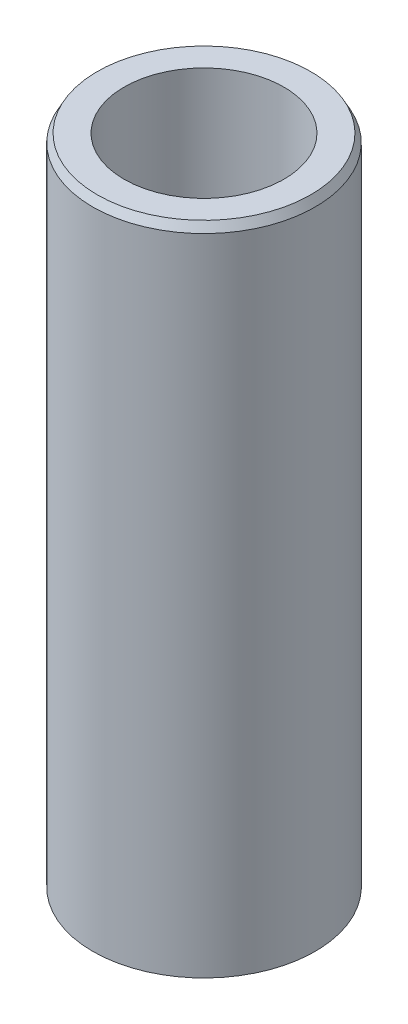
ISO-10303-21;
HEADER;
FILE_DESCRIPTION(('STEP AP214'),'2;1');
FILE_NAME('part.step','',(''),(''),'','','');
FILE_SCHEMA(('AUTOMOTIVE_DESIGN { 1 0 10303 214 1 1 1 1 }'));
ENDSEC;
DATA;
#1=APPLICATION_CONTEXT('core data for automotive mechanical design processes');
#2=APPLICATION_PROTOCOL_DEFINITION('international standard','automotive_design',2000,#1);
#3=PRODUCT_CONTEXT('',#1,'mechanical');
#4=PRODUCT('Part','Part','',(#3));
#5=PRODUCT_RELATED_PRODUCT_CATEGORY('part','',(#4));
#6=PRODUCT_DEFINITION_FORMATION('','',#4);
#7=PRODUCT_DEFINITION_CONTEXT('part definition',#1,'design');
#8=PRODUCT_DEFINITION('design','',#6,#7);
#9=PRODUCT_DEFINITION_SHAPE('','',#8);
#10=(LENGTH_UNIT() NAMED_UNIT(*) SI_UNIT(.MILLI.,.METRE.));
#11=(NAMED_UNIT(*) PLANE_ANGLE_UNIT() SI_UNIT($,.RADIAN.));
#12=(NAMED_UNIT(*) SI_UNIT($,.STERADIAN.) SOLID_ANGLE_UNIT());
#13=UNCERTAINTY_MEASURE_WITH_UNIT(LENGTH_MEASURE(1.E-05),#10,'distance_accuracy_value','');
#14=(GEOMETRIC_REPRESENTATION_CONTEXT(3) GLOBAL_UNCERTAINTY_ASSIGNED_CONTEXT((#13)) GLOBAL_UNIT_ASSIGNED_CONTEXT((#10,
#11,#12)) REPRESENTATION_CONTEXT('',''));
#15=CARTESIAN_POINT('',(0.,0.,0.));
#16=DIRECTION('',(0.,0.,1.));
#17=DIRECTION('',(1.,0.,0.));
#18=AXIS2_PLACEMENT_3D('',#15,#16,#17);
#19=CARTESIAN_POINT('',(0.,339.887566355256,0.));
#20=DIRECTION('',(0.,-1.,0.));
#21=DIRECTION('',(0.,0.,-1.));
#22=AXIS2_PLACEMENT_3D('',#19,#20,#21);
#23=CYLINDRICAL_SURFACE('',#22,57.5);
#24=CARTESIAN_POINT('',(0.,335.581742833972,0.));
#25=DIRECTION('',(0.,1.,0.));
#26=DIRECTION('',(0.,0.,1.));
#27=AXIS2_PLACEMENT_3D('',#24,#25,#26);
#28=CIRCLE('',#27,57.5);
#29=CARTESIAN_POINT('',(0.,335.581742833972,57.5));
#30=VERTEX_POINT('',#29);
#31=EDGE_CURVE('E50',#30,#30,#28,.F.);
#32=ORIENTED_EDGE('',*,*,#31,.T.);
#33=EDGE_LOOP('',(#32));
#34=FACE_BOUND('',#33,.T.);
#35=CARTESIAN_POINT('',(0.,2.30795267168399,0.));
#36=DIRECTION('',(0.,1.,0.));
#37=DIRECTION('',(0.,0.,1.));
#38=AXIS2_PLACEMENT_3D('',#35,#36,#37);
#39=CIRCLE('',#38,57.5);
#40=CARTESIAN_POINT('',(0.,2.30795267168399,57.5));
#41=VERTEX_POINT('',#40);
#42=EDGE_CURVE('E51',#41,#41,#39,.T.);
#43=ORIENTED_EDGE('',*,*,#42,.T.);
#44=EDGE_LOOP('',(#43));
#45=FACE_BOUND('',#44,.T.);
#46=ADVANCED_FACE('F39',(#34,#45),#23,.T.);
#47=CARTESIAN_POINT('',(0.,339.887566355256,0.));
#48=DIRECTION('',(0.,1.,0.));
#49=DIRECTION('',(0.,0.,1.));
#50=AXIS2_PLACEMENT_3D('',#47,#48,#49);
#51=PLANE('',#50);
#52=CARTESIAN_POINT('',(0.,339.887566355256,0.));
#53=DIRECTION('',(0.,1.,0.));
#54=DIRECTION('',(0.,0.,1.));
#55=AXIS2_PLACEMENT_3D('',#52,#53,#54);
#56=CIRCLE('',#55,55.1920473283161);
#57=CARTESIAN_POINT('',(0.,339.887566355256,55.1920473283161));
#58=VERTEX_POINT('',#57);
#59=EDGE_CURVE('E54',#58,#58,#56,.T.);
#60=ORIENTED_EDGE('',*,*,#59,.T.);
#61=EDGE_LOOP('',(#60));
#62=FACE_BOUND('',#61,.T.);
#63=CARTESIAN_POINT('',(0.,339.887566355256,0.));
#64=DIRECTION('',(0.,1.,0.));
#65=DIRECTION('',(0.,0.,1.));
#66=AXIS2_PLACEMENT_3D('',#63,#64,#65);
#67=CIRCLE('',#66,41.3139174017981);
#68=CARTESIAN_POINT('',(0.,339.887566355256,41.3139174017981));
#69=VERTEX_POINT('',#68);
#70=EDGE_CURVE('E58',#69,#69,#67,.T.);
#71=ORIENTED_EDGE('',*,*,#70,.F.);
#72=EDGE_LOOP('',(#71));
#73=FACE_BOUND('',#72,.T.);
#74=ADVANCED_FACE('F69',(#62,#73),#51,.T.);
#75=CARTESIAN_POINT('',(0.,0.,0.));
#76=DIRECTION('',(0.,1.,0.));
#77=DIRECTION('',(0.,0.,1.));
#78=AXIS2_PLACEMENT_3D('',#75,#76,#77);
#79=PLANE('',#78);
#80=CARTESIAN_POINT('',(0.,0.,0.));
#81=DIRECTION('',(0.,1.,0.));
#82=DIRECTION('',(0.,0.,1.));
#83=AXIS2_PLACEMENT_3D('',#80,#81,#82);
#84=CIRCLE('',#83,53.1941764787149);
#85=CARTESIAN_POINT('',(0.,0.,53.1941764787149));
#86=VERTEX_POINT('',#85);
#87=EDGE_CURVE('E10',#86,#86,#84,.F.);
#88=ORIENTED_EDGE('',*,*,#87,.T.);
#89=EDGE_LOOP('',(#88));
#90=FACE_BOUND('',#89,.T.);
#91=CARTESIAN_POINT('',(0.,0.,0.));
#92=DIRECTION('',(0.,1.,0.));
#93=DIRECTION('',(0.,0.,1.));
#94=AXIS2_PLACEMENT_3D('',#91,#92,#93);
#95=CIRCLE('',#94,41.3139174017981);
#96=CARTESIAN_POINT('',(0.,0.,41.3139174017981));
#97=VERTEX_POINT('',#96);
#98=EDGE_CURVE('E63',#97,#97,#95,.T.);
#99=ORIENTED_EDGE('',*,*,#98,.T.);
#100=EDGE_LOOP('',(#99));
#101=FACE_BOUND('',#100,.T.);
#102=ADVANCED_FACE('F75',(#90,#101),#79,.F.);
#103=CARTESIAN_POINT('',(0.,339.887566355256,0.));
#104=DIRECTION('',(0.,-1.,0.));
#105=DIRECTION('',(0.,0.,-1.));
#106=AXIS2_PLACEMENT_3D('',#103,#104,#105);
#107=CYLINDRICAL_SURFACE('',#106,41.3139174017981);
#108=ORIENTED_EDGE('',*,*,#70,.T.);
#109=EDGE_LOOP('',(#108));
#110=FACE_BOUND('',#109,.T.);
#111=ORIENTED_EDGE('',*,*,#98,.F.);
#112=EDGE_LOOP('',(#111));
#113=FACE_BOUND('',#112,.T.);
#114=ADVANCED_FACE('F70',(#110,#113),#107,.F.);
#115=CARTESIAN_POINT('',(0.,339.887566355256,0.));
#116=DIRECTION('',(0.,-1.,0.));
#117=DIRECTION('',(0.,0.,-1.));
#118=AXIS2_PLACEMENT_3D('',#115,#116,#117);
#119=CONICAL_SURFACE('',#118,55.1920473283161,0.49203679200024);
#120=ORIENTED_EDGE('',*,*,#31,.F.);
#121=EDGE_LOOP('',(#120));
#122=FACE_BOUND('',#121,.T.);
#123=ORIENTED_EDGE('',*,*,#59,.F.);
#124=EDGE_LOOP('',(#123));
#125=FACE_BOUND('',#124,.T.);
#126=ADVANCED_FACE('F81',(#122,#125),#119,.T.);
#127=CARTESIAN_POINT('',(0.,2.30795267168399,0.));
#128=DIRECTION('',(0.,1.,0.));
#129=DIRECTION('',(0.,0.,1.));
#130=AXIS2_PLACEMENT_3D('',#127,#128,#129);
#131=CONICAL_SURFACE('',#130,57.5,1.07875953479466);
#132=ORIENTED_EDGE('',*,*,#87,.F.);
#133=EDGE_LOOP('',(#132));
#134=FACE_BOUND('',#133,.T.);
#135=ORIENTED_EDGE('',*,*,#42,.F.);
#136=EDGE_LOOP('',(#135));
#137=FACE_BOUND('',#136,.T.);
#138=ADVANCED_FACE('F45',(#134,#137),#131,.T.);
#139=CLOSED_SHELL('',(#46,#74,#102,#114,#126,#138));
#140=MANIFOLD_SOLID_BREP('B2',#139);
#141=ADVANCED_BREP_SHAPE_REPRESENTATION('',(#18,#140),#14);
#142=SHAPE_DEFINITION_REPRESENTATION(#9,#141);
ENDSEC;
END-ISO-10303-21;
